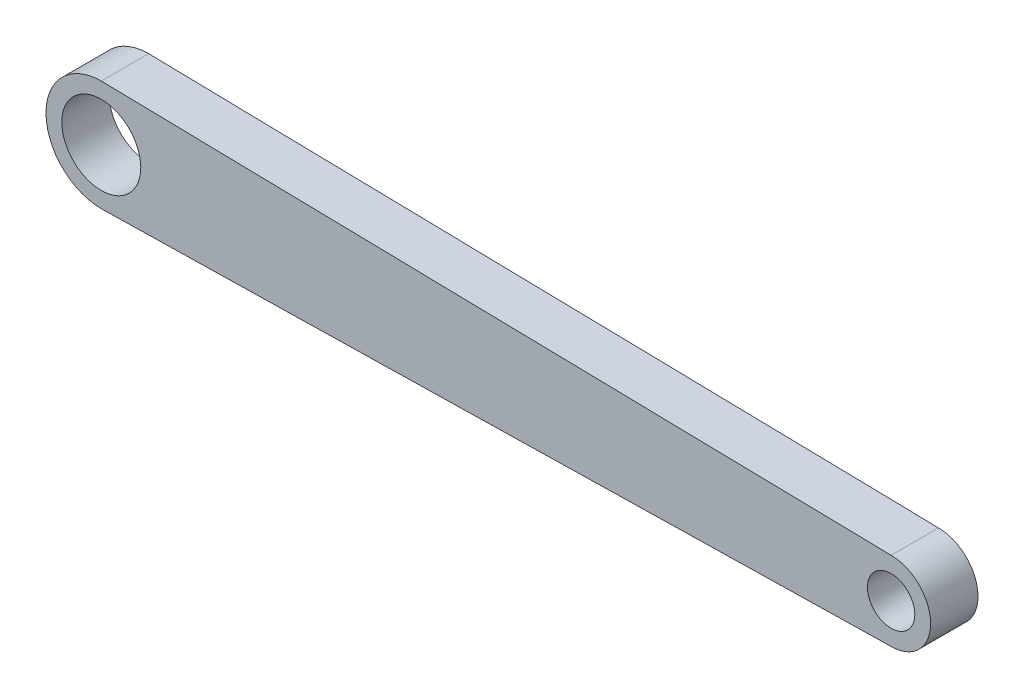
ISO-10303-21;
HEADER;
FILE_DESCRIPTION(('STEP AP214'),'2;1');
FILE_NAME('part.step','',(''),(''),'','','');
FILE_SCHEMA(('AUTOMOTIVE_DESIGN { 1 0 10303 214 1 1 1 1 }'));
ENDSEC;
DATA;
#1=APPLICATION_CONTEXT('core data for automotive mechanical design processes');
#2=APPLICATION_PROTOCOL_DEFINITION('international standard','automotive_design',2000,#1);
#3=PRODUCT_CONTEXT('',#1,'mechanical');
#4=PRODUCT('Part','Part','',(#3));
#5=PRODUCT_RELATED_PRODUCT_CATEGORY('part','',(#4));
#6=PRODUCT_DEFINITION_FORMATION('','',#4);
#7=PRODUCT_DEFINITION_CONTEXT('part definition',#1,'design');
#8=PRODUCT_DEFINITION('design','',#6,#7);
#9=PRODUCT_DEFINITION_SHAPE('','',#8);
#10=(LENGTH_UNIT() NAMED_UNIT(*) SI_UNIT(.MILLI.,.METRE.));
#11=(NAMED_UNIT(*) PLANE_ANGLE_UNIT() SI_UNIT($,.RADIAN.));
#12=(NAMED_UNIT(*) SI_UNIT($,.STERADIAN.) SOLID_ANGLE_UNIT());
#13=UNCERTAINTY_MEASURE_WITH_UNIT(LENGTH_MEASURE(1.E-05),#10,'distance_accuracy_value','');
#14=(GEOMETRIC_REPRESENTATION_CONTEXT(3) GLOBAL_UNCERTAINTY_ASSIGNED_CONTEXT((#13)) GLOBAL_UNIT_ASSIGNED_CONTEXT((#10,
#11,#12)) REPRESENTATION_CONTEXT('',''));
#15=CARTESIAN_POINT('',(0.,0.,0.));
#16=DIRECTION('',(0.,0.,1.));
#17=DIRECTION('',(1.,0.,0.));
#18=AXIS2_PLACEMENT_3D('',#15,#16,#17);
#19=CARTESIAN_POINT('',(0.0699720111955218,-3.49860055977609,3.));
#20=DIRECTION('',(-0.0199960011996001,0.999800059980007,0.));
#21=DIRECTION('',(-0.999800059980007,-0.0199960011996002,0.));
#22=AXIS2_PLACEMENT_3D('',#19,#20,#21);
#23=PLANE('',#22);
#24=DIRECTION('',(0.999800059980007,0.0199960011996001,0.));
#25=VECTOR('',#24,1.);
#26=CARTESIAN_POINT('',(0.0699720111955218,-3.49860055977609,0.));
#27=LINE('',#26,#25);
#28=CARTESIAN_POINT('',(0.,-3.5,0.));
#29=VERTEX_POINT('',#28);
#30=CARTESIAN_POINT('',(50.,-2.5,0.));
#31=VERTEX_POINT('',#30);
#32=EDGE_CURVE('E110',#29,#31,#27,.T.);
#33=ORIENTED_EDGE('',*,*,#32,.T.);
#34=DIRECTION('',(0.,0.,-1.));
#35=VECTOR('',#34,1.);
#36=CARTESIAN_POINT('',(50.,-2.5,3.));
#37=LINE('',#36,#35);
#38=CARTESIAN_POINT('',(50.,-2.5,3.));
#39=VERTEX_POINT('',#38);
#40=EDGE_CURVE('E11',#39,#31,#37,.T.);
#41=ORIENTED_EDGE('',*,*,#40,.F.);
#42=DIRECTION('',(0.999800059980007,0.0199960011996001,0.));
#43=VECTOR('',#42,1.);
#44=CARTESIAN_POINT('',(0.0699720111955218,-3.49860055977609,3.));
#45=LINE('',#44,#43);
#46=CARTESIAN_POINT('',(0.,-3.5,3.));
#47=VERTEX_POINT('',#46);
#48=EDGE_CURVE('E89',#47,#39,#45,.T.);
#49=ORIENTED_EDGE('',*,*,#48,.F.);
#50=DIRECTION('',(0.,0.,-1.));
#51=VECTOR('',#50,1.);
#52=CARTESIAN_POINT('',(0.,-3.5,3.));
#53=LINE('',#52,#51);
#54=EDGE_CURVE('E100',#47,#29,#53,.T.);
#55=ORIENTED_EDGE('',*,*,#54,.T.);
#56=EDGE_LOOP('',(#33,#41,#49,#55));
#57=FACE_BOUND('',#56,.T.);
#58=ADVANCED_FACE('F41',(#57),#23,.F.);
#59=CARTESIAN_POINT('',(50.,0.,3.));
#60=DIRECTION('',(0.,0.,-1.));
#61=DIRECTION('',(-1.,0.,0.));
#62=AXIS2_PLACEMENT_3D('',#59,#60,#61);
#63=CYLINDRICAL_SURFACE('',#62,2.5);
#64=CARTESIAN_POINT('',(50.,0.,0.));
#65=DIRECTION('',(0.,0.,1.));
#66=DIRECTION('',(1.,0.,0.));
#67=AXIS2_PLACEMENT_3D('',#64,#65,#66);
#68=CIRCLE('',#67,2.5);
#69=CARTESIAN_POINT('',(50.,2.5,0.));
#70=VERTEX_POINT('',#69);
#71=EDGE_CURVE('E94',#31,#70,#68,.T.);
#72=ORIENTED_EDGE('',*,*,#71,.T.);
#73=DIRECTION('',(0.,0.,-1.));
#74=VECTOR('',#73,1.);
#75=CARTESIAN_POINT('',(50.,2.5,3.));
#76=LINE('',#75,#74);
#77=CARTESIAN_POINT('',(50.,2.5,3.));
#78=VERTEX_POINT('',#77);
#79=EDGE_CURVE('E50',#78,#70,#76,.T.);
#80=ORIENTED_EDGE('',*,*,#79,.F.);
#81=CARTESIAN_POINT('',(50.,0.,3.));
#82=DIRECTION('',(0.,0.,1.));
#83=DIRECTION('',(1.,0.,0.));
#84=AXIS2_PLACEMENT_3D('',#81,#82,#83);
#85=CIRCLE('',#84,2.5);
#86=EDGE_CURVE('E84',#39,#78,#85,.T.);
#87=ORIENTED_EDGE('',*,*,#86,.F.);
#88=ORIENTED_EDGE('',*,*,#40,.T.);
#89=EDGE_LOOP('',(#72,#80,#87,#88));
#90=FACE_BOUND('',#89,.T.);
#91=ADVANCED_FACE('F93',(#90),#63,.T.);
#92=CARTESIAN_POINT('',(0.0699720111955218,3.49860055977609,3.));
#93=DIRECTION('',(0.0199960011996001,0.999800059980007,0.));
#94=DIRECTION('',(-0.999800059980007,0.0199960011996002,0.));
#95=AXIS2_PLACEMENT_3D('',#92,#93,#94);
#96=PLANE('',#95);
#97=DIRECTION('',(0.999800059980007,-0.0199960011996001,0.));
#98=VECTOR('',#97,1.);
#99=CARTESIAN_POINT('',(0.0699720111955218,3.49860055977609,0.));
#100=LINE('',#99,#98);
#101=CARTESIAN_POINT('',(0.,3.5,0.));
#102=VERTEX_POINT('',#101);
#103=EDGE_CURVE('E114',#102,#70,#100,.T.);
#104=ORIENTED_EDGE('',*,*,#103,.F.);
#105=DIRECTION('',(0.,0.,-1.));
#106=VECTOR('',#105,1.);
#107=CARTESIAN_POINT('',(0.,3.5,3.));
#108=LINE('',#107,#106);
#109=CARTESIAN_POINT('',(0.,3.5,3.));
#110=VERTEX_POINT('',#109);
#111=EDGE_CURVE('E74',#110,#102,#108,.T.);
#112=ORIENTED_EDGE('',*,*,#111,.F.);
#113=DIRECTION('',(0.999800059980007,-0.0199960011996001,0.));
#114=VECTOR('',#113,1.);
#115=CARTESIAN_POINT('',(0.0699720111955218,3.49860055977609,3.));
#116=LINE('',#115,#114);
#117=EDGE_CURVE('E87',#110,#78,#116,.T.);
#118=ORIENTED_EDGE('',*,*,#117,.T.);
#119=ORIENTED_EDGE('',*,*,#79,.T.);
#120=EDGE_LOOP('',(#104,#112,#118,#119));
#121=FACE_BOUND('',#120,.T.);
#122=ADVANCED_FACE('F98',(#121),#96,.T.);
#123=CARTESIAN_POINT('',(0.,0.,3.));
#124=DIRECTION('',(0.,0.,-1.));
#125=DIRECTION('',(-1.,0.,0.));
#126=AXIS2_PLACEMENT_3D('',#123,#124,#125);
#127=CYLINDRICAL_SURFACE('',#126,2.5);
#128=CARTESIAN_POINT('',(0.,0.,3.));
#129=DIRECTION('',(0.,0.,1.));
#130=DIRECTION('',(1.,0.,0.));
#131=AXIS2_PLACEMENT_3D('',#128,#129,#130);
#132=CIRCLE('',#131,2.5);
#133=CARTESIAN_POINT('',(2.5,0.,3.));
#134=VERTEX_POINT('',#133);
#135=EDGE_CURVE('E152',#134,#134,#132,.T.);
#136=ORIENTED_EDGE('',*,*,#135,.T.);
#137=EDGE_LOOP('',(#136));
#138=FACE_BOUND('',#137,.T.);
#139=CARTESIAN_POINT('',(0.,0.,0.));
#140=DIRECTION('',(0.,0.,1.));
#141=DIRECTION('',(1.,0.,0.));
#142=AXIS2_PLACEMENT_3D('',#139,#140,#141);
#143=CIRCLE('',#142,2.5);
#144=CARTESIAN_POINT('',(2.5,0.,0.));
#145=VERTEX_POINT('',#144);
#146=EDGE_CURVE('E107',#145,#145,#143,.T.);
#147=ORIENTED_EDGE('',*,*,#146,.F.);
#148=EDGE_LOOP('',(#147));
#149=FACE_BOUND('',#148,.T.);
#150=ADVANCED_FACE('F141',(#138,#149),#127,.F.);
#151=CARTESIAN_POINT('',(50.,0.,3.));
#152=DIRECTION('',(0.,0.,-1.));
#153=DIRECTION('',(-1.,0.,0.));
#154=AXIS2_PLACEMENT_3D('',#151,#152,#153);
#155=CYLINDRICAL_SURFACE('',#154,1.5);
#156=CARTESIAN_POINT('',(50.,0.,3.));
#157=DIRECTION('',(0.,0.,1.));
#158=DIRECTION('',(1.,0.,0.));
#159=AXIS2_PLACEMENT_3D('',#156,#157,#158);
#160=CIRCLE('',#159,1.5);
#161=CARTESIAN_POINT('',(51.5,0.,3.));
#162=VERTEX_POINT('',#161);
#163=EDGE_CURVE('E117',#162,#162,#160,.T.);
#164=ORIENTED_EDGE('',*,*,#163,.T.);
#165=EDGE_LOOP('',(#164));
#166=FACE_BOUND('',#165,.T.);
#167=CARTESIAN_POINT('',(50.,0.,0.));
#168=DIRECTION('',(0.,0.,1.));
#169=DIRECTION('',(1.,0.,0.));
#170=AXIS2_PLACEMENT_3D('',#167,#168,#169);
#171=CIRCLE('',#170,1.5);
#172=CARTESIAN_POINT('',(51.5,0.,0.));
#173=VERTEX_POINT('',#172);
#174=EDGE_CURVE('E104',#173,#173,#171,.T.);
#175=ORIENTED_EDGE('',*,*,#174,.F.);
#176=EDGE_LOOP('',(#175));
#177=FACE_BOUND('',#176,.T.);
#178=ADVANCED_FACE('F43',(#166,#177),#155,.F.);
#179=CARTESIAN_POINT('',(0.,0.,3.));
#180=DIRECTION('',(0.,0.,-1.));
#181=DIRECTION('',(-1.,0.,0.));
#182=AXIS2_PLACEMENT_3D('',#179,#180,#181);
#183=CYLINDRICAL_SURFACE('',#182,3.5);
#184=CARTESIAN_POINT('',(0.,0.,0.));
#185=DIRECTION('',(0.,0.,1.));
#186=DIRECTION('',(1.,0.,0.));
#187=AXIS2_PLACEMENT_3D('',#184,#185,#186);
#188=CIRCLE('',#187,3.5);
#189=EDGE_CURVE('E77',#102,#29,#188,.T.);
#190=ORIENTED_EDGE('',*,*,#189,.T.);
#191=ORIENTED_EDGE('',*,*,#54,.F.);
#192=CARTESIAN_POINT('',(0.,0.,3.));
#193=DIRECTION('',(0.,0.,1.));
#194=DIRECTION('',(1.,0.,0.));
#195=AXIS2_PLACEMENT_3D('',#192,#193,#194);
#196=CIRCLE('',#195,3.5);
#197=EDGE_CURVE('E58',#110,#47,#196,.T.);
#198=ORIENTED_EDGE('',*,*,#197,.F.);
#199=ORIENTED_EDGE('',*,*,#111,.T.);
#200=EDGE_LOOP('',(#190,#191,#198,#199));
#201=FACE_BOUND('',#200,.T.);
#202=ADVANCED_FACE('F129',(#201),#183,.T.);
#203=CARTESIAN_POINT('',(0.,0.,3.));
#204=DIRECTION('',(0.,0.,1.));
#205=DIRECTION('',(1.,0.,0.));
#206=AXIS2_PLACEMENT_3D('',#203,#204,#205);
#207=PLANE('',#206);
#208=ORIENTED_EDGE('',*,*,#163,.F.);
#209=EDGE_LOOP('',(#208));
#210=FACE_BOUND('',#209,.T.);
#211=ORIENTED_EDGE('',*,*,#135,.F.);
#212=EDGE_LOOP('',(#211));
#213=FACE_BOUND('',#212,.T.);
#214=ORIENTED_EDGE('',*,*,#48,.T.);
#215=ORIENTED_EDGE('',*,*,#86,.T.);
#216=ORIENTED_EDGE('',*,*,#117,.F.);
#217=ORIENTED_EDGE('',*,*,#197,.T.);
#218=EDGE_LOOP('',(#214,#215,#216,#217));
#219=FACE_BOUND('',#218,.T.);
#220=ADVANCED_FACE('F85',(#210,#213,#219),#207,.T.);
#221=CARTESIAN_POINT('',(0.,0.,0.));
#222=DIRECTION('',(0.,0.,1.));
#223=DIRECTION('',(1.,0.,0.));
#224=AXIS2_PLACEMENT_3D('',#221,#222,#223);
#225=PLANE('',#224);
#226=ORIENTED_EDGE('',*,*,#174,.T.);
#227=EDGE_LOOP('',(#226));
#228=FACE_BOUND('',#227,.T.);
#229=ORIENTED_EDGE('',*,*,#146,.T.);
#230=EDGE_LOOP('',(#229));
#231=FACE_BOUND('',#230,.T.);
#232=ORIENTED_EDGE('',*,*,#32,.F.);
#233=ORIENTED_EDGE('',*,*,#189,.F.);
#234=ORIENTED_EDGE('',*,*,#103,.T.);
#235=ORIENTED_EDGE('',*,*,#71,.F.);
#236=EDGE_LOOP('',(#232,#233,#234,#235));
#237=FACE_BOUND('',#236,.T.);
#238=ADVANCED_FACE('F122',(#228,#231,#237),#225,.F.);
#239=CLOSED_SHELL('',(#58,#91,#122,#150,#178,#202,#220,#238));
#240=MANIFOLD_SOLID_BREP('B2',#239);
#241=ADVANCED_BREP_SHAPE_REPRESENTATION('',(#18,#240),#14);
#242=SHAPE_DEFINITION_REPRESENTATION(#9,#241);
ENDSEC;
END-ISO-10303-21;
